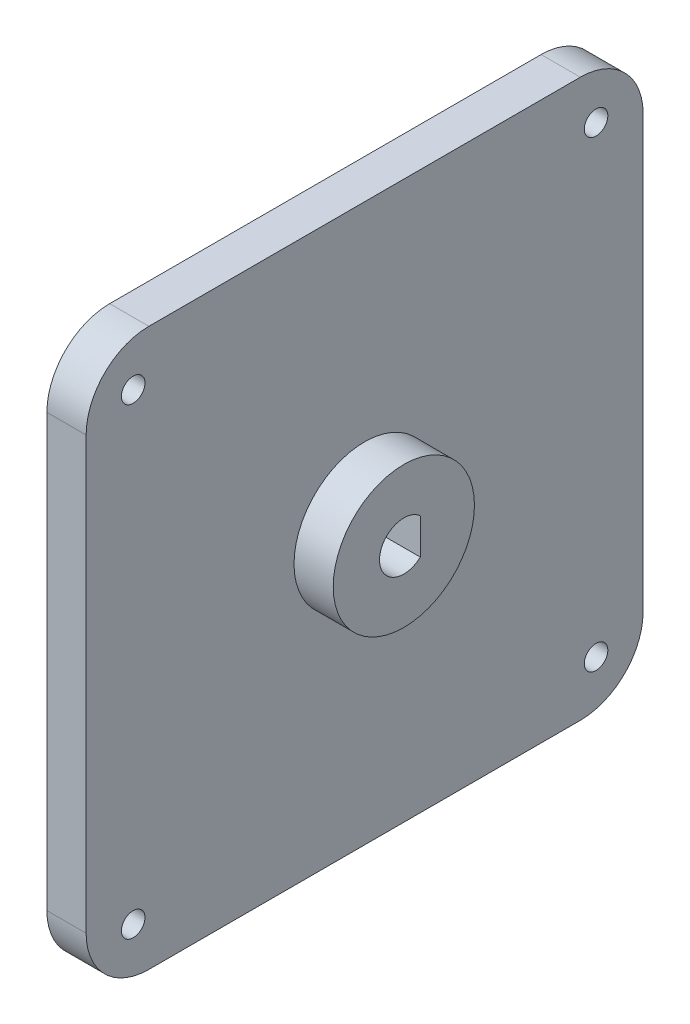
ISO-10303-21;
HEADER;
FILE_DESCRIPTION(('STEP AP214'),'2;1');
FILE_NAME('part.step','',(''),(''),'','','');
FILE_SCHEMA(('AUTOMOTIVE_DESIGN { 1 0 10303 214 1 1 1 1 }'));
ENDSEC;
DATA;
#1=APPLICATION_CONTEXT('core data for automotive mechanical design processes');
#2=APPLICATION_PROTOCOL_DEFINITION('international standard','automotive_design',2000,#1);
#3=PRODUCT_CONTEXT('',#1,'mechanical');
#4=PRODUCT('Part','Part','',(#3));
#5=PRODUCT_RELATED_PRODUCT_CATEGORY('part','',(#4));
#6=PRODUCT_DEFINITION_FORMATION('','',#4);
#7=PRODUCT_DEFINITION_CONTEXT('part definition',#1,'design');
#8=PRODUCT_DEFINITION('design','',#6,#7);
#9=PRODUCT_DEFINITION_SHAPE('','',#8);
#10=(LENGTH_UNIT() NAMED_UNIT(*) SI_UNIT(.MILLI.,.METRE.));
#11=(NAMED_UNIT(*) PLANE_ANGLE_UNIT() SI_UNIT($,.RADIAN.));
#12=(NAMED_UNIT(*) SI_UNIT($,.STERADIAN.) SOLID_ANGLE_UNIT());
#13=UNCERTAINTY_MEASURE_WITH_UNIT(LENGTH_MEASURE(1.E-05),#10,'distance_accuracy_value','');
#14=(GEOMETRIC_REPRESENTATION_CONTEXT(3) GLOBAL_UNCERTAINTY_ASSIGNED_CONTEXT((#13)) GLOBAL_UNIT_ASSIGNED_CONTEXT((#10,
#11,#12)) REPRESENTATION_CONTEXT('',''));
#15=CARTESIAN_POINT('',(0.,0.,0.));
#16=DIRECTION('',(0.,0.,1.));
#17=DIRECTION('',(1.,0.,0.));
#18=AXIS2_PLACEMENT_3D('',#15,#16,#17);
#19=CARTESIAN_POINT('',(0.,0.,0.));
#20=DIRECTION('',(-1.,0.,0.));
#21=DIRECTION('',(0.,0.,1.));
#22=AXIS2_PLACEMENT_3D('',#19,#20,#21);
#23=PLANE('',#22);
#24=CARTESIAN_POINT('',(0.,6.,-65.));
#25=DIRECTION('',(1.,0.,0.));
#26=DIRECTION('',(0.,0.,-1.));
#27=AXIS2_PLACEMENT_3D('',#24,#25,#26);
#28=CIRCLE('',#27,1.5);
#29=CARTESIAN_POINT('',(0.,6.,-66.5));
#30=VERTEX_POINT('',#29);
#31=EDGE_CURVE('E127',#30,#30,#28,.T.);
#32=ORIENTED_EDGE('',*,*,#31,.T.);
#33=EDGE_LOOP('',(#32));
#34=FACE_BOUND('',#33,.T.);
#35=CARTESIAN_POINT('',(0.,65.,-6.));
#36=DIRECTION('',(1.,0.,0.));
#37=DIRECTION('',(0.,0.,-1.));
#38=AXIS2_PLACEMENT_3D('',#35,#36,#37);
#39=CIRCLE('',#38,1.5);
#40=CARTESIAN_POINT('',(0.,65.,-7.5));
#41=VERTEX_POINT('',#40);
#42=EDGE_CURVE('E137',#41,#41,#39,.T.);
#43=ORIENTED_EDGE('',*,*,#42,.T.);
#44=EDGE_LOOP('',(#43));
#45=FACE_BOUND('',#44,.T.);
#46=DIRECTION('',(0.,0.,-1.));
#47=VECTOR('',#46,1.);
#48=CARTESIAN_POINT('',(0.,0.,0.));
#49=LINE('',#48,#47);
#50=CARTESIAN_POINT('',(0.,0.,-8.));
#51=VERTEX_POINT('',#50);
#52=CARTESIAN_POINT('',(0.,0.,-63.));
#53=VERTEX_POINT('',#52);
#54=EDGE_CURVE('E168',#51,#53,#49,.T.);
#55=ORIENTED_EDGE('',*,*,#54,.F.);
#56=CARTESIAN_POINT('',(0.,8.,-8.));
#57=DIRECTION('',(-1.,0.,0.));
#58=DIRECTION('',(0.,0.,1.));
#59=AXIS2_PLACEMENT_3D('',#56,#57,#58);
#60=CIRCLE('',#59,8.);
#61=CARTESIAN_POINT('',(0.,8.,0.));
#62=VERTEX_POINT('',#61);
#63=EDGE_CURVE('E186',#51,#62,#60,.T.);
#64=ORIENTED_EDGE('',*,*,#63,.T.);
#65=DIRECTION('',(0.,-1.,0.));
#66=VECTOR('',#65,1.);
#67=CARTESIAN_POINT('',(0.,0.,0.));
#68=LINE('',#67,#66);
#69=CARTESIAN_POINT('',(0.,63.,0.));
#70=VERTEX_POINT('',#69);
#71=EDGE_CURVE('E149',#70,#62,#68,.T.);
#72=ORIENTED_EDGE('',*,*,#71,.F.);
#73=CARTESIAN_POINT('',(0.,63.,-8.));
#74=DIRECTION('',(-1.,0.,0.));
#75=DIRECTION('',(0.,0.,1.));
#76=AXIS2_PLACEMENT_3D('',#73,#74,#75);
#77=CIRCLE('',#76,8.);
#78=CARTESIAN_POINT('',(0.,71.,-8.));
#79=VERTEX_POINT('',#78);
#80=EDGE_CURVE('E180',#70,#79,#77,.T.);
#81=ORIENTED_EDGE('',*,*,#80,.T.);
#82=DIRECTION('',(0.,0.,1.));
#83=VECTOR('',#82,1.);
#84=CARTESIAN_POINT('',(0.,71.,0.));
#85=LINE('',#84,#83);
#86=CARTESIAN_POINT('',(0.,71.,-63.));
#87=VERTEX_POINT('',#86);
#88=EDGE_CURVE('E156',#87,#79,#85,.T.);
#89=ORIENTED_EDGE('',*,*,#88,.F.);
#90=CARTESIAN_POINT('',(0.,63.,-63.));
#91=DIRECTION('',(-1.,0.,0.));
#92=DIRECTION('',(0.,0.,1.));
#93=AXIS2_PLACEMENT_3D('',#90,#91,#92);
#94=CIRCLE('',#93,8.);
#95=CARTESIAN_POINT('',(0.,63.,-71.));
#96=VERTEX_POINT('',#95);
#97=EDGE_CURVE('E182',#87,#96,#94,.T.);
#98=ORIENTED_EDGE('',*,*,#97,.T.);
#99=DIRECTION('',(0.,1.,0.));
#100=VECTOR('',#99,1.);
#101=CARTESIAN_POINT('',(0.,0.,-71.));
#102=LINE('',#101,#100);
#103=CARTESIAN_POINT('',(0.,8.,-71.));
#104=VERTEX_POINT('',#103);
#105=EDGE_CURVE('E171',#104,#96,#102,.T.);
#106=ORIENTED_EDGE('',*,*,#105,.F.);
#107=CARTESIAN_POINT('',(0.,8.,-63.));
#108=DIRECTION('',(-1.,0.,0.));
#109=DIRECTION('',(0.,0.,1.));
#110=AXIS2_PLACEMENT_3D('',#107,#108,#109);
#111=CIRCLE('',#110,8.);
#112=EDGE_CURVE('E184',#104,#53,#111,.T.);
#113=ORIENTED_EDGE('',*,*,#112,.T.);
#114=EDGE_LOOP('',(#55,#64,#72,#81,#89,#98,#106,#113));
#115=FACE_BOUND('',#114,.T.);
#116=CARTESIAN_POINT('',(0.,6.,-6.));
#117=DIRECTION('',(1.,0.,0.));
#118=DIRECTION('',(0.,0.,-1.));
#119=AXIS2_PLACEMENT_3D('',#116,#117,#118);
#120=CIRCLE('',#119,1.5);
#121=CARTESIAN_POINT('',(0.,6.,-7.5));
#122=VERTEX_POINT('',#121);
#123=EDGE_CURVE('E143',#122,#122,#120,.T.);
#124=ORIENTED_EDGE('',*,*,#123,.T.);
#125=EDGE_LOOP('',(#124));
#126=FACE_BOUND('',#125,.T.);
#127=CARTESIAN_POINT('',(0.,65.,-65.));
#128=DIRECTION('',(1.,0.,0.));
#129=DIRECTION('',(0.,0.,-1.));
#130=AXIS2_PLACEMENT_3D('',#127,#128,#129);
#131=CIRCLE('',#130,1.5);
#132=CARTESIAN_POINT('',(0.,65.,-66.5));
#133=VERTEX_POINT('',#132);
#134=EDGE_CURVE('E131',#133,#133,#131,.T.);
#135=ORIENTED_EDGE('',*,*,#134,.T.);
#136=EDGE_LOOP('',(#135));
#137=FACE_BOUND('',#136,.T.);
#138=CARTESIAN_POINT('',(0.,35.5,-35.5));
#139=DIRECTION('',(1.,0.,0.));
#140=DIRECTION('',(0.,0.,-1.));
#141=AXIS2_PLACEMENT_3D('',#138,#139,#140);
#142=CIRCLE('',#141,3.1);
#143=CARTESIAN_POINT('',(0.,37.7803508501983,-37.6));
#144=VERTEX_POINT('',#143);
#145=CARTESIAN_POINT('',(0.,33.2196491498017,-37.6));
#146=VERTEX_POINT('',#145);
#147=EDGE_CURVE('E113',#144,#146,#142,.T.);
#148=ORIENTED_EDGE('',*,*,#147,.T.);
#149=DIRECTION('',(0.,-1.,0.));
#150=VECTOR('',#149,1.);
#151=CARTESIAN_POINT('',(0.,0.,-37.6));
#152=LINE('',#151,#150);
#153=EDGE_CURVE('E110',#144,#146,#152,.T.);
#154=ORIENTED_EDGE('',*,*,#153,.F.);
#155=EDGE_LOOP('',(#148,#154));
#156=FACE_BOUND('',#155,.T.);
#157=ADVANCED_FACE('F32',(#34,#45,#115,#126,#137,#156),#23,.T.);
#158=CARTESIAN_POINT('',(10.,35.5,-35.5));
#159=DIRECTION('',(1.,0.,0.));
#160=DIRECTION('',(0.,0.,-1.));
#161=AXIS2_PLACEMENT_3D('',#158,#159,#160);
#162=PLANE('',#161);
#163=CARTESIAN_POINT('',(10.,35.5,-35.5));
#164=DIRECTION('',(1.,0.,0.));
#165=DIRECTION('',(0.,0.,-1.));
#166=AXIS2_PLACEMENT_3D('',#163,#164,#165);
#167=CIRCLE('',#166,9.);
#168=CARTESIAN_POINT('',(10.,35.5,-44.5));
#169=VERTEX_POINT('',#168);
#170=EDGE_CURVE('E123',#169,#169,#167,.T.);
#171=ORIENTED_EDGE('',*,*,#170,.T.);
#172=EDGE_LOOP('',(#171));
#173=FACE_BOUND('',#172,.T.);
#174=CARTESIAN_POINT('',(10.,35.5,-35.5));
#175=DIRECTION('',(1.,0.,0.));
#176=DIRECTION('',(0.,0.,-1.));
#177=AXIS2_PLACEMENT_3D('',#174,#175,#176);
#178=CIRCLE('',#177,3.1);
#179=CARTESIAN_POINT('',(10.,37.7803508501983,-37.6));
#180=VERTEX_POINT('',#179);
#181=CARTESIAN_POINT('',(10.,33.2196491498017,-37.6));
#182=VERTEX_POINT('',#181);
#183=EDGE_CURVE('E118',#180,#182,#178,.T.);
#184=ORIENTED_EDGE('',*,*,#183,.F.);
#185=DIRECTION('',(0.,-1.,0.));
#186=VECTOR('',#185,1.);
#187=CARTESIAN_POINT('',(10.,0.,-37.6));
#188=LINE('',#187,#186);
#189=EDGE_CURVE('E54',#180,#182,#188,.T.);
#190=ORIENTED_EDGE('',*,*,#189,.T.);
#191=EDGE_LOOP('',(#184,#190));
#192=FACE_BOUND('',#191,.T.);
#193=ADVANCED_FACE('F256',(#173,#192),#162,.T.);
#194=CARTESIAN_POINT('',(5.,0.,0.));
#195=DIRECTION('',(-1.,0.,0.));
#196=DIRECTION('',(0.,0.,1.));
#197=AXIS2_PLACEMENT_3D('',#194,#195,#196);
#198=PLANE('',#197);
#199=CARTESIAN_POINT('',(5.,6.,-65.));
#200=DIRECTION('',(1.,0.,0.));
#201=DIRECTION('',(0.,0.,-1.));
#202=AXIS2_PLACEMENT_3D('',#199,#200,#201);
#203=CIRCLE('',#202,1.5);
#204=CARTESIAN_POINT('',(5.,6.,-66.5));
#205=VERTEX_POINT('',#204);
#206=EDGE_CURVE('E128',#205,#205,#203,.T.);
#207=ORIENTED_EDGE('',*,*,#206,.F.);
#208=EDGE_LOOP('',(#207));
#209=FACE_BOUND('',#208,.T.);
#210=CARTESIAN_POINT('',(5.,65.,-6.));
#211=DIRECTION('',(1.,0.,0.));
#212=DIRECTION('',(0.,0.,-1.));
#213=AXIS2_PLACEMENT_3D('',#210,#211,#212);
#214=CIRCLE('',#213,1.5);
#215=CARTESIAN_POINT('',(5.,65.,-7.5));
#216=VERTEX_POINT('',#215);
#217=EDGE_CURVE('E140',#216,#216,#214,.T.);
#218=ORIENTED_EDGE('',*,*,#217,.F.);
#219=EDGE_LOOP('',(#218));
#220=FACE_BOUND('',#219,.T.);
#221=DIRECTION('',(0.,-1.,0.));
#222=VECTOR('',#221,1.);
#223=CARTESIAN_POINT('',(5.,0.,0.));
#224=LINE('',#223,#222);
#225=CARTESIAN_POINT('',(5.,63.,0.));
#226=VERTEX_POINT('',#225);
#227=CARTESIAN_POINT('',(5.,8.,0.));
#228=VERTEX_POINT('',#227);
#229=EDGE_CURVE('E152',#226,#228,#224,.T.);
#230=ORIENTED_EDGE('',*,*,#229,.T.);
#231=CARTESIAN_POINT('',(5.,8.,-8.));
#232=DIRECTION('',(-1.,0.,0.));
#233=DIRECTION('',(0.,0.,1.));
#234=AXIS2_PLACEMENT_3D('',#231,#232,#233);
#235=CIRCLE('',#234,8.);
#236=CARTESIAN_POINT('',(5.,0.,-8.));
#237=VERTEX_POINT('',#236);
#238=EDGE_CURVE('E199',#228,#237,#235,.F.);
#239=ORIENTED_EDGE('',*,*,#238,.T.);
#240=DIRECTION('',(0.,0.,-1.));
#241=VECTOR('',#240,1.);
#242=CARTESIAN_POINT('',(5.,0.,0.));
#243=LINE('',#242,#241);
#244=CARTESIAN_POINT('',(5.,0.,-63.));
#245=VERTEX_POINT('',#244);
#246=EDGE_CURVE('E155',#237,#245,#243,.T.);
#247=ORIENTED_EDGE('',*,*,#246,.T.);
#248=CARTESIAN_POINT('',(5.,8.,-63.));
#249=DIRECTION('',(-1.,0.,0.));
#250=DIRECTION('',(0.,0.,1.));
#251=AXIS2_PLACEMENT_3D('',#248,#249,#250);
#252=CIRCLE('',#251,8.);
#253=CARTESIAN_POINT('',(5.,8.,-71.));
#254=VERTEX_POINT('',#253);
#255=EDGE_CURVE('E197',#245,#254,#252,.F.);
#256=ORIENTED_EDGE('',*,*,#255,.T.);
#257=DIRECTION('',(0.,1.,0.));
#258=VECTOR('',#257,1.);
#259=CARTESIAN_POINT('',(5.,0.,-71.));
#260=LINE('',#259,#258);
#261=CARTESIAN_POINT('',(5.,63.,-71.));
#262=VERTEX_POINT('',#261);
#263=EDGE_CURVE('E159',#254,#262,#260,.T.);
#264=ORIENTED_EDGE('',*,*,#263,.T.);
#265=CARTESIAN_POINT('',(5.,63.,-63.));
#266=DIRECTION('',(-1.,0.,0.));
#267=DIRECTION('',(0.,0.,1.));
#268=AXIS2_PLACEMENT_3D('',#265,#266,#267);
#269=CIRCLE('',#268,8.);
#270=CARTESIAN_POINT('',(5.,71.,-63.));
#271=VERTEX_POINT('',#270);
#272=EDGE_CURVE('E195',#262,#271,#269,.F.);
#273=ORIENTED_EDGE('',*,*,#272,.T.);
#274=DIRECTION('',(0.,0.,1.));
#275=VECTOR('',#274,1.);
#276=CARTESIAN_POINT('',(5.,71.,0.));
#277=LINE('',#276,#275);
#278=CARTESIAN_POINT('',(5.,71.,-8.));
#279=VERTEX_POINT('',#278);
#280=EDGE_CURVE('E162',#271,#279,#277,.T.);
#281=ORIENTED_EDGE('',*,*,#280,.T.);
#282=CARTESIAN_POINT('',(5.,63.,-8.));
#283=DIRECTION('',(-1.,0.,0.));
#284=DIRECTION('',(0.,0.,1.));
#285=AXIS2_PLACEMENT_3D('',#282,#283,#284);
#286=CIRCLE('',#285,8.);
#287=EDGE_CURVE('E193',#279,#226,#286,.F.);
#288=ORIENTED_EDGE('',*,*,#287,.T.);
#289=EDGE_LOOP('',(#230,#239,#247,#256,#264,#273,#281,#288));
#290=FACE_BOUND('',#289,.T.);
#291=CARTESIAN_POINT('',(5.,6.,-6.));
#292=DIRECTION('',(1.,0.,0.));
#293=DIRECTION('',(0.,0.,-1.));
#294=AXIS2_PLACEMENT_3D('',#291,#292,#293);
#295=CIRCLE('',#294,1.5);
#296=CARTESIAN_POINT('',(5.,6.,-7.5));
#297=VERTEX_POINT('',#296);
#298=EDGE_CURVE('E146',#297,#297,#295,.T.);
#299=ORIENTED_EDGE('',*,*,#298,.F.);
#300=EDGE_LOOP('',(#299));
#301=FACE_BOUND('',#300,.T.);
#302=CARTESIAN_POINT('',(5.,65.,-65.));
#303=DIRECTION('',(1.,0.,0.));
#304=DIRECTION('',(0.,0.,-1.));
#305=AXIS2_PLACEMENT_3D('',#302,#303,#304);
#306=CIRCLE('',#305,1.5);
#307=CARTESIAN_POINT('',(5.,65.,-66.5));
#308=VERTEX_POINT('',#307);
#309=EDGE_CURVE('E134',#308,#308,#306,.T.);
#310=ORIENTED_EDGE('',*,*,#309,.F.);
#311=EDGE_LOOP('',(#310));
#312=FACE_BOUND('',#311,.T.);
#313=CARTESIAN_POINT('',(5.,35.5,-35.5));
#314=DIRECTION('',(-1.,0.,0.));
#315=DIRECTION('',(0.,0.,1.));
#316=AXIS2_PLACEMENT_3D('',#313,#314,#315);
#317=CIRCLE('',#316,9.);
#318=CARTESIAN_POINT('',(5.,35.5,-26.5));
#319=VERTEX_POINT('',#318);
#320=EDGE_CURVE('E11',#319,#319,#317,.F.);
#321=ORIENTED_EDGE('',*,*,#320,.F.);
#322=EDGE_LOOP('',(#321));
#323=FACE_BOUND('',#322,.T.);
#324=ADVANCED_FACE('F230',(#209,#220,#290,#301,#312,#323),#198,.F.);
#325=CARTESIAN_POINT('',(5.,0.,0.));
#326=DIRECTION('',(0.,0.,-1.));
#327=DIRECTION('',(-1.,0.,0.));
#328=AXIS2_PLACEMENT_3D('',#325,#326,#327);
#329=PLANE('',#328);
#330=ORIENTED_EDGE('',*,*,#71,.T.);
#331=DIRECTION('',(-1.,0.,0.));
#332=VECTOR('',#331,1.);
#333=CARTESIAN_POINT('',(5.,8.,0.));
#334=LINE('',#333,#332);
#335=EDGE_CURVE('E191',#62,#228,#334,.F.);
#336=ORIENTED_EDGE('',*,*,#335,.T.);
#337=ORIENTED_EDGE('',*,*,#229,.F.);
#338=DIRECTION('',(-1.,0.,0.));
#339=VECTOR('',#338,1.);
#340=CARTESIAN_POINT('',(5.,63.,0.));
#341=LINE('',#340,#339);
#342=EDGE_CURVE('E188',#226,#70,#341,.T.);
#343=ORIENTED_EDGE('',*,*,#342,.T.);
#344=EDGE_LOOP('',(#330,#336,#337,#343));
#345=FACE_BOUND('',#344,.T.);
#346=ADVANCED_FACE('F226',(#345),#329,.F.);
#347=CARTESIAN_POINT('',(5.,0.,0.));
#348=DIRECTION('',(0.,1.,0.));
#349=DIRECTION('',(0.,0.,1.));
#350=AXIS2_PLACEMENT_3D('',#347,#348,#349);
#351=PLANE('',#350);
#352=ORIENTED_EDGE('',*,*,#246,.F.);
#353=DIRECTION('',(-1.,0.,0.));
#354=VECTOR('',#353,1.);
#355=CARTESIAN_POINT('',(5.,0.,-8.));
#356=LINE('',#355,#354);
#357=EDGE_CURVE('E177',#237,#51,#356,.T.);
#358=ORIENTED_EDGE('',*,*,#357,.T.);
#359=ORIENTED_EDGE('',*,*,#54,.T.);
#360=DIRECTION('',(-1.,0.,0.));
#361=VECTOR('',#360,1.);
#362=CARTESIAN_POINT('',(5.,0.,-63.));
#363=LINE('',#362,#361);
#364=EDGE_CURVE('E165',#53,#245,#363,.F.);
#365=ORIENTED_EDGE('',*,*,#364,.T.);
#366=EDGE_LOOP('',(#352,#358,#359,#365));
#367=FACE_BOUND('',#366,.T.);
#368=ADVANCED_FACE('F237',(#367),#351,.F.);
#369=CARTESIAN_POINT('',(5.,0.,-71.));
#370=DIRECTION('',(0.,0.,1.));
#371=DIRECTION('',(1.,0.,0.));
#372=AXIS2_PLACEMENT_3D('',#369,#370,#371);
#373=PLANE('',#372);
#374=ORIENTED_EDGE('',*,*,#263,.F.);
#375=DIRECTION('',(-1.,0.,0.));
#376=VECTOR('',#375,1.);
#377=CARTESIAN_POINT('',(5.,8.,-71.));
#378=LINE('',#377,#376);
#379=EDGE_CURVE('E203',#254,#104,#378,.T.);
#380=ORIENTED_EDGE('',*,*,#379,.T.);
#381=ORIENTED_EDGE('',*,*,#105,.T.);
#382=DIRECTION('',(-1.,0.,0.));
#383=VECTOR('',#382,1.);
#384=CARTESIAN_POINT('',(5.,63.,-71.));
#385=LINE('',#384,#383);
#386=EDGE_CURVE('E201',#96,#262,#385,.F.);
#387=ORIENTED_EDGE('',*,*,#386,.T.);
#388=EDGE_LOOP('',(#374,#380,#381,#387));
#389=FACE_BOUND('',#388,.T.);
#390=ADVANCED_FACE('F245',(#389),#373,.F.);
#391=CARTESIAN_POINT('',(5.,71.,0.));
#392=DIRECTION('',(0.,-1.,0.));
#393=DIRECTION('',(0.,0.,-1.));
#394=AXIS2_PLACEMENT_3D('',#391,#392,#393);
#395=PLANE('',#394);
#396=ORIENTED_EDGE('',*,*,#280,.F.);
#397=DIRECTION('',(-1.,0.,0.));
#398=VECTOR('',#397,1.);
#399=CARTESIAN_POINT('',(5.,71.,-63.));
#400=LINE('',#399,#398);
#401=EDGE_CURVE('E40',#271,#87,#400,.T.);
#402=ORIENTED_EDGE('',*,*,#401,.T.);
#403=ORIENTED_EDGE('',*,*,#88,.T.);
#404=DIRECTION('',(-1.,0.,0.));
#405=VECTOR('',#404,1.);
#406=CARTESIAN_POINT('',(5.,71.,-8.));
#407=LINE('',#406,#405);
#408=EDGE_CURVE('E206',#79,#279,#407,.F.);
#409=ORIENTED_EDGE('',*,*,#408,.T.);
#410=EDGE_LOOP('',(#396,#402,#403,#409));
#411=FACE_BOUND('',#410,.T.);
#412=ADVANCED_FACE('F212',(#411),#395,.F.);
#413=CARTESIAN_POINT('',(5.,6.,-6.));
#414=DIRECTION('',(-1.,0.,0.));
#415=DIRECTION('',(0.,0.,1.));
#416=AXIS2_PLACEMENT_3D('',#413,#414,#415);
#417=CYLINDRICAL_SURFACE('',#416,1.5);
#418=ORIENTED_EDGE('',*,*,#298,.T.);
#419=EDGE_LOOP('',(#418));
#420=FACE_BOUND('',#419,.T.);
#421=ORIENTED_EDGE('',*,*,#123,.F.);
#422=EDGE_LOOP('',(#421));
#423=FACE_BOUND('',#422,.T.);
#424=ADVANCED_FACE('F270',(#420,#423),#417,.F.);
#425=CARTESIAN_POINT('',(5.,65.,-6.));
#426=DIRECTION('',(-1.,0.,0.));
#427=DIRECTION('',(0.,0.,1.));
#428=AXIS2_PLACEMENT_3D('',#425,#426,#427);
#429=CYLINDRICAL_SURFACE('',#428,1.5);
#430=ORIENTED_EDGE('',*,*,#217,.T.);
#431=EDGE_LOOP('',(#430));
#432=FACE_BOUND('',#431,.T.);
#433=ORIENTED_EDGE('',*,*,#42,.F.);
#434=EDGE_LOOP('',(#433));
#435=FACE_BOUND('',#434,.T.);
#436=ADVANCED_FACE('F288',(#432,#435),#429,.F.);
#437=CARTESIAN_POINT('',(5.,65.,-65.));
#438=DIRECTION('',(-1.,0.,0.));
#439=DIRECTION('',(0.,0.,1.));
#440=AXIS2_PLACEMENT_3D('',#437,#438,#439);
#441=CYLINDRICAL_SURFACE('',#440,1.5);
#442=ORIENTED_EDGE('',*,*,#309,.T.);
#443=EDGE_LOOP('',(#442));
#444=FACE_BOUND('',#443,.T.);
#445=ORIENTED_EDGE('',*,*,#134,.F.);
#446=EDGE_LOOP('',(#445));
#447=FACE_BOUND('',#446,.T.);
#448=ADVANCED_FACE('F282',(#444,#447),#441,.F.);
#449=CARTESIAN_POINT('',(5.,6.,-65.));
#450=DIRECTION('',(-1.,0.,0.));
#451=DIRECTION('',(0.,0.,1.));
#452=AXIS2_PLACEMENT_3D('',#449,#450,#451);
#453=CYLINDRICAL_SURFACE('',#452,1.5);
#454=ORIENTED_EDGE('',*,*,#206,.T.);
#455=EDGE_LOOP('',(#454));
#456=FACE_BOUND('',#455,.T.);
#457=ORIENTED_EDGE('',*,*,#31,.F.);
#458=EDGE_LOOP('',(#457));
#459=FACE_BOUND('',#458,.T.);
#460=ADVANCED_FACE('F278',(#456,#459),#453,.F.);
#461=CARTESIAN_POINT('',(5.,8.,-8.));
#462=DIRECTION('',(-1.,0.,0.));
#463=DIRECTION('',(0.,0.,1.));
#464=AXIS2_PLACEMENT_3D('',#461,#462,#463);
#465=CYLINDRICAL_SURFACE('',#464,8.);
#466=ORIENTED_EDGE('',*,*,#238,.F.);
#467=ORIENTED_EDGE('',*,*,#335,.F.);
#468=ORIENTED_EDGE('',*,*,#63,.F.);
#469=ORIENTED_EDGE('',*,*,#357,.F.);
#470=EDGE_LOOP('',(#466,#467,#468,#469));
#471=FACE_BOUND('',#470,.T.);
#472=ADVANCED_FACE('F235',(#471),#465,.T.);
#473=CARTESIAN_POINT('',(5.,8.,-63.));
#474=DIRECTION('',(-1.,0.,0.));
#475=DIRECTION('',(0.,0.,1.));
#476=AXIS2_PLACEMENT_3D('',#473,#474,#475);
#477=CYLINDRICAL_SURFACE('',#476,8.);
#478=ORIENTED_EDGE('',*,*,#255,.F.);
#479=ORIENTED_EDGE('',*,*,#364,.F.);
#480=ORIENTED_EDGE('',*,*,#112,.F.);
#481=ORIENTED_EDGE('',*,*,#379,.F.);
#482=EDGE_LOOP('',(#478,#479,#480,#481));
#483=FACE_BOUND('',#482,.T.);
#484=ADVANCED_FACE('F242',(#483),#477,.T.);
#485=CARTESIAN_POINT('',(5.,63.,-63.));
#486=DIRECTION('',(-1.,0.,0.));
#487=DIRECTION('',(0.,0.,1.));
#488=AXIS2_PLACEMENT_3D('',#485,#486,#487);
#489=CYLINDRICAL_SURFACE('',#488,8.);
#490=ORIENTED_EDGE('',*,*,#272,.F.);
#491=ORIENTED_EDGE('',*,*,#386,.F.);
#492=ORIENTED_EDGE('',*,*,#97,.F.);
#493=ORIENTED_EDGE('',*,*,#401,.F.);
#494=EDGE_LOOP('',(#490,#491,#492,#493));
#495=FACE_BOUND('',#494,.T.);
#496=ADVANCED_FACE('F247',(#495),#489,.T.);
#497=CARTESIAN_POINT('',(5.,63.,-8.));
#498=DIRECTION('',(-1.,0.,0.));
#499=DIRECTION('',(0.,0.,1.));
#500=AXIS2_PLACEMENT_3D('',#497,#498,#499);
#501=CYLINDRICAL_SURFACE('',#500,8.);
#502=ORIENTED_EDGE('',*,*,#287,.F.);
#503=ORIENTED_EDGE('',*,*,#408,.F.);
#504=ORIENTED_EDGE('',*,*,#80,.F.);
#505=ORIENTED_EDGE('',*,*,#342,.F.);
#506=EDGE_LOOP('',(#502,#503,#504,#505));
#507=FACE_BOUND('',#506,.T.);
#508=ADVANCED_FACE('F34',(#507),#501,.T.);
#509=CARTESIAN_POINT('',(10.,35.5,-35.5));
#510=DIRECTION('',(-1.,0.,0.));
#511=DIRECTION('',(0.,0.,1.));
#512=AXIS2_PLACEMENT_3D('',#509,#510,#511);
#513=CYLINDRICAL_SURFACE('',#512,9.);
#514=ORIENTED_EDGE('',*,*,#170,.F.);
#515=EDGE_LOOP('',(#514));
#516=FACE_BOUND('',#515,.T.);
#517=ORIENTED_EDGE('',*,*,#320,.T.);
#518=EDGE_LOOP('',(#517));
#519=FACE_BOUND('',#518,.T.);
#520=ADVANCED_FACE('F253',(#516,#519),#513,.T.);
#521=CARTESIAN_POINT('',(0.,0.,-37.6));
#522=DIRECTION('',(0.,0.,1.));
#523=DIRECTION('',(1.,0.,0.));
#524=AXIS2_PLACEMENT_3D('',#521,#522,#523);
#525=PLANE('',#524);
#526=ORIENTED_EDGE('',*,*,#189,.F.);
#527=DIRECTION('',(1.,0.,0.));
#528=VECTOR('',#527,1.);
#529=CARTESIAN_POINT('',(0.,37.7803508501983,-37.6));
#530=LINE('',#529,#528);
#531=EDGE_CURVE('E107',#144,#180,#530,.T.);
#532=ORIENTED_EDGE('',*,*,#531,.F.);
#533=ORIENTED_EDGE('',*,*,#153,.T.);
#534=DIRECTION('',(1.,0.,0.));
#535=VECTOR('',#534,1.);
#536=CARTESIAN_POINT('',(0.,33.2196491498017,-37.6));
#537=LINE('',#536,#535);
#538=EDGE_CURVE('E47',#146,#182,#537,.T.);
#539=ORIENTED_EDGE('',*,*,#538,.T.);
#540=EDGE_LOOP('',(#526,#532,#533,#539));
#541=FACE_BOUND('',#540,.T.);
#542=ADVANCED_FACE('F108',(#541),#525,.T.);
#543=CARTESIAN_POINT('',(0.,35.5,-35.5));
#544=DIRECTION('',(1.,0.,0.));
#545=DIRECTION('',(0.,0.,-1.));
#546=AXIS2_PLACEMENT_3D('',#543,#544,#545);
#547=CYLINDRICAL_SURFACE('',#546,3.1);
#548=ORIENTED_EDGE('',*,*,#183,.T.);
#549=ORIENTED_EDGE('',*,*,#538,.F.);
#550=ORIENTED_EDGE('',*,*,#147,.F.);
#551=ORIENTED_EDGE('',*,*,#531,.T.);
#552=EDGE_LOOP('',(#548,#549,#550,#551));
#553=FACE_BOUND('',#552,.T.);
#554=ADVANCED_FACE('F115',(#553),#547,.F.);
#555=CLOSED_SHELL('',(#157,#193,#324,#346,#368,#390,#412,#424,#436,#448,#460,#472,#484,#496,
#508,#520,#542,#554));
#556=MANIFOLD_SOLID_BREP('B2',#555);
#557=ADVANCED_BREP_SHAPE_REPRESENTATION('',(#18,#556),#14);
#558=SHAPE_DEFINITION_REPRESENTATION(#9,#557);
ENDSEC;
END-ISO-10303-21;
